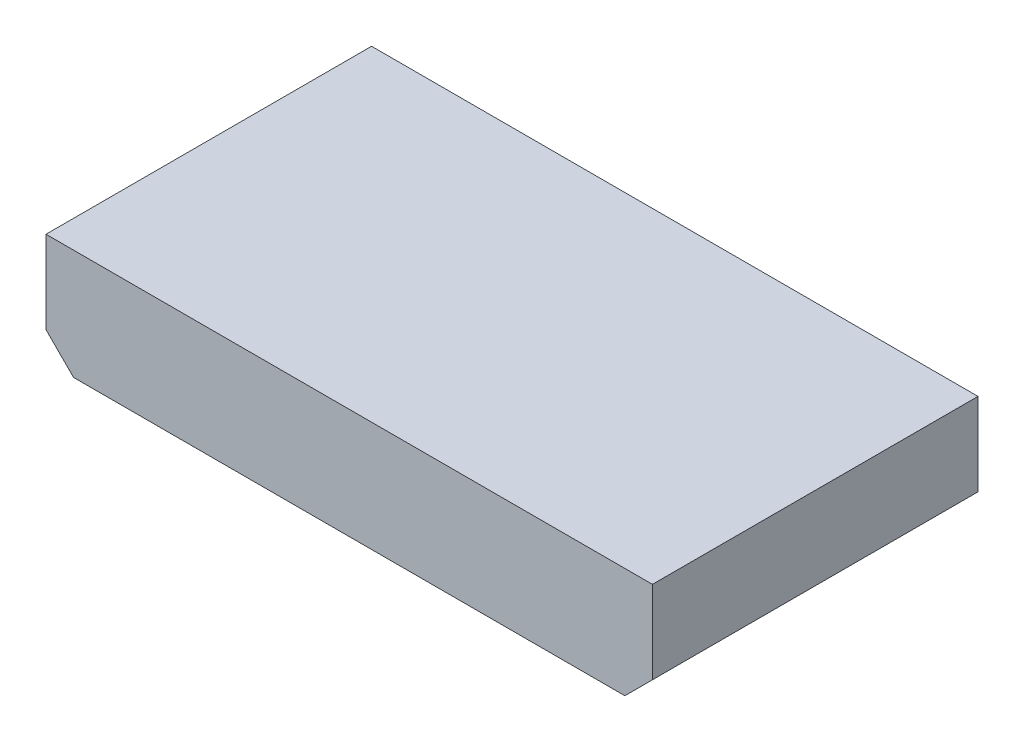
ISO-10303-21;
HEADER;
FILE_DESCRIPTION(('STEP AP214'),'2;1');
FILE_NAME('part.step','',(''),(''),'','','');
FILE_SCHEMA(('AUTOMOTIVE_DESIGN { 1 0 10303 214 1 1 1 1 }'));
ENDSEC;
DATA;
#1=APPLICATION_CONTEXT('core data for automotive mechanical design processes');
#2=APPLICATION_PROTOCOL_DEFINITION('international standard','automotive_design',2000,#1);
#3=PRODUCT_CONTEXT('',#1,'mechanical');
#4=PRODUCT('Part','Part','',(#3));
#5=PRODUCT_RELATED_PRODUCT_CATEGORY('part','',(#4));
#6=PRODUCT_DEFINITION_FORMATION('','',#4);
#7=PRODUCT_DEFINITION_CONTEXT('part definition',#1,'design');
#8=PRODUCT_DEFINITION('design','',#6,#7);
#9=PRODUCT_DEFINITION_SHAPE('','',#8);
#10=(LENGTH_UNIT() NAMED_UNIT(*) SI_UNIT(.MILLI.,.METRE.));
#11=(NAMED_UNIT(*) PLANE_ANGLE_UNIT() SI_UNIT($,.RADIAN.));
#12=(NAMED_UNIT(*) SI_UNIT($,.STERADIAN.) SOLID_ANGLE_UNIT());
#13=UNCERTAINTY_MEASURE_WITH_UNIT(LENGTH_MEASURE(1.E-05),#10,'distance_accuracy_value','');
#14=(GEOMETRIC_REPRESENTATION_CONTEXT(3) GLOBAL_UNCERTAINTY_ASSIGNED_CONTEXT((#13)) GLOBAL_UNIT_ASSIGNED_CONTEXT((#10,
#11,#12)) REPRESENTATION_CONTEXT('',''));
#15=CARTESIAN_POINT('',(0.,0.,0.));
#16=DIRECTION('',(0.,0.,1.));
#17=DIRECTION('',(1.,0.,0.));
#18=AXIS2_PLACEMENT_3D('',#15,#16,#17);
#19=CARTESIAN_POINT('',(17.78,0.,-2.));
#20=DIRECTION('',(0.,0.,1.));
#21=DIRECTION('',(1.,0.,0.));
#22=AXIS2_PLACEMENT_3D('',#19,#20,#21);
#23=CYLINDRICAL_SURFACE('',#22,0.25);
#24=CARTESIAN_POINT('',(17.78,0.,-2.));
#25=DIRECTION('',(0.,0.,1.));
#26=DIRECTION('',(1.,0.,0.));
#27=AXIS2_PLACEMENT_3D('',#24,#25,#26);
#28=CIRCLE('',#27,0.25);
#29=CARTESIAN_POINT('',(18.03,0.,-2.));
#30=VERTEX_POINT('',#29);
#31=EDGE_CURVE('E11',#30,#30,#28,.T.);
#32=ORIENTED_EDGE('',*,*,#31,.T.);
#33=EDGE_LOOP('',(#32));
#34=FACE_BOUND('',#33,.T.);
#35=CARTESIAN_POINT('',(17.78,0.,0.));
#36=DIRECTION('',(0.,0.,1.));
#37=DIRECTION('',(1.,0.,0.));
#38=AXIS2_PLACEMENT_3D('',#35,#36,#37);
#39=CIRCLE('',#38,0.25);
#40=CARTESIAN_POINT('',(18.03,0.,0.));
#41=VERTEX_POINT('',#40);
#42=EDGE_CURVE('E43',#41,#41,#39,.T.);
#43=ORIENTED_EDGE('',*,*,#42,.F.);
#44=EDGE_LOOP('',(#43));
#45=FACE_BOUND('',#44,.T.);
#46=ADVANCED_FACE('F40',(#34,#45),#23,.T.);
#47=CARTESIAN_POINT('',(17.78,0.,-2.));
#48=DIRECTION('',(0.,0.,1.));
#49=DIRECTION('',(1.,0.,0.));
#50=AXIS2_PLACEMENT_3D('',#47,#48,#49);
#51=PLANE('',#50);
#52=ORIENTED_EDGE('',*,*,#31,.F.);
#53=EDGE_LOOP('',(#52));
#54=FACE_BOUND('',#53,.T.);
#55=ADVANCED_FACE('F55',(#54),#51,.F.);
#56=CARTESIAN_POINT('',(17.78,0.,0.));
#57=DIRECTION('',(0.,0.,1.));
#58=DIRECTION('',(1.,0.,0.));
#59=AXIS2_PLACEMENT_3D('',#56,#57,#58);
#60=PLANE('',#59);
#61=ORIENTED_EDGE('',*,*,#42,.T.);
#62=EDGE_LOOP('',(#61));
#63=FACE_BOUND('',#62,.T.);
#64=ADVANCED_FACE('F52',(#63),#60,.T.);
#65=CLOSED_SHELL('',(#46,#55,#64));
#66=MANIFOLD_SOLID_BREP('B2',#65);
#67=CARTESIAN_POINT('',(15.24,0.,-2.));
#68=DIRECTION('',(0.,0.,1.));
#69=DIRECTION('',(1.,0.,0.));
#70=AXIS2_PLACEMENT_3D('',#67,#68,#69);
#71=CYLINDRICAL_SURFACE('',#70,0.25);
#72=CARTESIAN_POINT('',(15.24,0.,-2.));
#73=DIRECTION('',(0.,0.,1.));
#74=DIRECTION('',(1.,0.,0.));
#75=AXIS2_PLACEMENT_3D('',#72,#73,#74);
#76=CIRCLE('',#75,0.25);
#77=CARTESIAN_POINT('',(15.49,0.,-2.));
#78=VERTEX_POINT('',#77);
#79=EDGE_CURVE('E39',#78,#78,#76,.T.);
#80=ORIENTED_EDGE('',*,*,#79,.T.);
#81=EDGE_LOOP('',(#80));
#82=FACE_BOUND('',#81,.T.);
#83=CARTESIAN_POINT('',(15.24,0.,0.));
#84=DIRECTION('',(0.,0.,1.));
#85=DIRECTION('',(1.,0.,0.));
#86=AXIS2_PLACEMENT_3D('',#83,#84,#85);
#87=CIRCLE('',#86,0.25);
#88=CARTESIAN_POINT('',(15.49,0.,0.));
#89=VERTEX_POINT('',#88);
#90=EDGE_CURVE('E92',#89,#89,#87,.T.);
#91=ORIENTED_EDGE('',*,*,#90,.F.);
#92=EDGE_LOOP('',(#91));
#93=FACE_BOUND('',#92,.T.);
#94=ADVANCED_FACE('F89',(#82,#93),#71,.T.);
#95=CARTESIAN_POINT('',(15.24,0.,-2.));
#96=DIRECTION('',(0.,0.,1.));
#97=DIRECTION('',(1.,0.,0.));
#98=AXIS2_PLACEMENT_3D('',#95,#96,#97);
#99=PLANE('',#98);
#100=ORIENTED_EDGE('',*,*,#79,.F.);
#101=EDGE_LOOP('',(#100));
#102=FACE_BOUND('',#101,.T.);
#103=ADVANCED_FACE('F104',(#102),#99,.F.);
#104=CARTESIAN_POINT('',(15.24,0.,0.));
#105=DIRECTION('',(0.,0.,1.));
#106=DIRECTION('',(1.,0.,0.));
#107=AXIS2_PLACEMENT_3D('',#104,#105,#106);
#108=PLANE('',#107);
#109=ORIENTED_EDGE('',*,*,#90,.T.);
#110=EDGE_LOOP('',(#109));
#111=FACE_BOUND('',#110,.T.);
#112=ADVANCED_FACE('F101',(#111),#108,.T.);
#113=CLOSED_SHELL('',(#94,#103,#112));
#114=MANIFOLD_SOLID_BREP('B6',#113);
#115=CARTESIAN_POINT('',(12.7,0.,-2.));
#116=DIRECTION('',(0.,0.,1.));
#117=DIRECTION('',(1.,0.,0.));
#118=AXIS2_PLACEMENT_3D('',#115,#116,#117);
#119=CYLINDRICAL_SURFACE('',#118,0.25);
#120=CARTESIAN_POINT('',(12.7,0.,-2.));
#121=DIRECTION('',(0.,0.,1.));
#122=DIRECTION('',(1.,0.,0.));
#123=AXIS2_PLACEMENT_3D('',#120,#121,#122);
#124=CIRCLE('',#123,0.25);
#125=CARTESIAN_POINT('',(12.95,0.,-2.));
#126=VERTEX_POINT('',#125);
#127=EDGE_CURVE('E88',#126,#126,#124,.T.);
#128=ORIENTED_EDGE('',*,*,#127,.T.);
#129=EDGE_LOOP('',(#128));
#130=FACE_BOUND('',#129,.T.);
#131=CARTESIAN_POINT('',(12.7,0.,0.));
#132=DIRECTION('',(0.,0.,1.));
#133=DIRECTION('',(1.,0.,0.));
#134=AXIS2_PLACEMENT_3D('',#131,#132,#133);
#135=CIRCLE('',#134,0.25);
#136=CARTESIAN_POINT('',(12.95,0.,0.));
#137=VERTEX_POINT('',#136);
#138=EDGE_CURVE('E141',#137,#137,#135,.T.);
#139=ORIENTED_EDGE('',*,*,#138,.F.);
#140=EDGE_LOOP('',(#139));
#141=FACE_BOUND('',#140,.T.);
#142=ADVANCED_FACE('F138',(#130,#141),#119,.T.);
#143=CARTESIAN_POINT('',(12.7,0.,-2.));
#144=DIRECTION('',(0.,0.,1.));
#145=DIRECTION('',(1.,0.,0.));
#146=AXIS2_PLACEMENT_3D('',#143,#144,#145);
#147=PLANE('',#146);
#148=ORIENTED_EDGE('',*,*,#127,.F.);
#149=EDGE_LOOP('',(#148));
#150=FACE_BOUND('',#149,.T.);
#151=ADVANCED_FACE('F153',(#150),#147,.F.);
#152=CARTESIAN_POINT('',(12.7,0.,0.));
#153=DIRECTION('',(0.,0.,1.));
#154=DIRECTION('',(1.,0.,0.));
#155=AXIS2_PLACEMENT_3D('',#152,#153,#154);
#156=PLANE('',#155);
#157=ORIENTED_EDGE('',*,*,#138,.T.);
#158=EDGE_LOOP('',(#157));
#159=FACE_BOUND('',#158,.T.);
#160=ADVANCED_FACE('F150',(#159),#156,.T.);
#161=CLOSED_SHELL('',(#142,#151,#160));
#162=MANIFOLD_SOLID_BREP('B34',#161);
#163=CARTESIAN_POINT('',(10.16,0.,-2.));
#164=DIRECTION('',(0.,0.,1.));
#165=DIRECTION('',(1.,0.,0.));
#166=AXIS2_PLACEMENT_3D('',#163,#164,#165);
#167=CYLINDRICAL_SURFACE('',#166,0.25);
#168=CARTESIAN_POINT('',(10.16,0.,-2.));
#169=DIRECTION('',(0.,0.,1.));
#170=DIRECTION('',(1.,0.,0.));
#171=AXIS2_PLACEMENT_3D('',#168,#169,#170);
#172=CIRCLE('',#171,0.25);
#173=CARTESIAN_POINT('',(10.41,0.,-2.));
#174=VERTEX_POINT('',#173);
#175=EDGE_CURVE('E137',#174,#174,#172,.T.);
#176=ORIENTED_EDGE('',*,*,#175,.T.);
#177=EDGE_LOOP('',(#176));
#178=FACE_BOUND('',#177,.T.);
#179=CARTESIAN_POINT('',(10.16,0.,0.));
#180=DIRECTION('',(0.,0.,1.));
#181=DIRECTION('',(1.,0.,0.));
#182=AXIS2_PLACEMENT_3D('',#179,#180,#181);
#183=CIRCLE('',#182,0.25);
#184=CARTESIAN_POINT('',(10.41,0.,0.));
#185=VERTEX_POINT('',#184);
#186=EDGE_CURVE('E190',#185,#185,#183,.T.);
#187=ORIENTED_EDGE('',*,*,#186,.F.);
#188=EDGE_LOOP('',(#187));
#189=FACE_BOUND('',#188,.T.);
#190=ADVANCED_FACE('F187',(#178,#189),#167,.T.);
#191=CARTESIAN_POINT('',(10.16,0.,-2.));
#192=DIRECTION('',(0.,0.,1.));
#193=DIRECTION('',(1.,0.,0.));
#194=AXIS2_PLACEMENT_3D('',#191,#192,#193);
#195=PLANE('',#194);
#196=ORIENTED_EDGE('',*,*,#175,.F.);
#197=EDGE_LOOP('',(#196));
#198=FACE_BOUND('',#197,.T.);
#199=ADVANCED_FACE('F202',(#198),#195,.F.);
#200=CARTESIAN_POINT('',(10.16,0.,0.));
#201=DIRECTION('',(0.,0.,1.));
#202=DIRECTION('',(1.,0.,0.));
#203=AXIS2_PLACEMENT_3D('',#200,#201,#202);
#204=PLANE('',#203);
#205=ORIENTED_EDGE('',*,*,#186,.T.);
#206=EDGE_LOOP('',(#205));
#207=FACE_BOUND('',#206,.T.);
#208=ADVANCED_FACE('F199',(#207),#204,.T.);
#209=CLOSED_SHELL('',(#190,#199,#208));
#210=MANIFOLD_SOLID_BREP('B83',#209);
#211=CARTESIAN_POINT('',(7.62,0.,-2.));
#212=DIRECTION('',(0.,0.,1.));
#213=DIRECTION('',(1.,0.,0.));
#214=AXIS2_PLACEMENT_3D('',#211,#212,#213);
#215=CYLINDRICAL_SURFACE('',#214,0.25);
#216=CARTESIAN_POINT('',(7.62,0.,-2.));
#217=DIRECTION('',(0.,0.,1.));
#218=DIRECTION('',(1.,0.,0.));
#219=AXIS2_PLACEMENT_3D('',#216,#217,#218);
#220=CIRCLE('',#219,0.25);
#221=CARTESIAN_POINT('',(7.87,0.,-2.));
#222=VERTEX_POINT('',#221);
#223=EDGE_CURVE('E186',#222,#222,#220,.T.);
#224=ORIENTED_EDGE('',*,*,#223,.T.);
#225=EDGE_LOOP('',(#224));
#226=FACE_BOUND('',#225,.T.);
#227=CARTESIAN_POINT('',(7.62,0.,0.));
#228=DIRECTION('',(0.,0.,1.));
#229=DIRECTION('',(1.,0.,0.));
#230=AXIS2_PLACEMENT_3D('',#227,#228,#229);
#231=CIRCLE('',#230,0.25);
#232=CARTESIAN_POINT('',(7.87,0.,0.));
#233=VERTEX_POINT('',#232);
#234=EDGE_CURVE('E239',#233,#233,#231,.T.);
#235=ORIENTED_EDGE('',*,*,#234,.F.);
#236=EDGE_LOOP('',(#235));
#237=FACE_BOUND('',#236,.T.);
#238=ADVANCED_FACE('F236',(#226,#237),#215,.T.);
#239=CARTESIAN_POINT('',(7.62,0.,-2.));
#240=DIRECTION('',(0.,0.,1.));
#241=DIRECTION('',(1.,0.,0.));
#242=AXIS2_PLACEMENT_3D('',#239,#240,#241);
#243=PLANE('',#242);
#244=ORIENTED_EDGE('',*,*,#223,.F.);
#245=EDGE_LOOP('',(#244));
#246=FACE_BOUND('',#245,.T.);
#247=ADVANCED_FACE('F251',(#246),#243,.F.);
#248=CARTESIAN_POINT('',(7.62,0.,0.));
#249=DIRECTION('',(0.,0.,1.));
#250=DIRECTION('',(1.,0.,0.));
#251=AXIS2_PLACEMENT_3D('',#248,#249,#250);
#252=PLANE('',#251);
#253=ORIENTED_EDGE('',*,*,#234,.T.);
#254=EDGE_LOOP('',(#253));
#255=FACE_BOUND('',#254,.T.);
#256=ADVANCED_FACE('F248',(#255),#252,.T.);
#257=CLOSED_SHELL('',(#238,#247,#256));
#258=MANIFOLD_SOLID_BREP('B132',#257);
#259=CARTESIAN_POINT('',(5.08,0.,-2.));
#260=DIRECTION('',(0.,0.,1.));
#261=DIRECTION('',(1.,0.,0.));
#262=AXIS2_PLACEMENT_3D('',#259,#260,#261);
#263=CYLINDRICAL_SURFACE('',#262,0.25);
#264=CARTESIAN_POINT('',(5.08,0.,-2.));
#265=DIRECTION('',(0.,0.,1.));
#266=DIRECTION('',(1.,0.,0.));
#267=AXIS2_PLACEMENT_3D('',#264,#265,#266);
#268=CIRCLE('',#267,0.25);
#269=CARTESIAN_POINT('',(5.33,0.,-2.));
#270=VERTEX_POINT('',#269);
#271=EDGE_CURVE('E235',#270,#270,#268,.T.);
#272=ORIENTED_EDGE('',*,*,#271,.T.);
#273=EDGE_LOOP('',(#272));
#274=FACE_BOUND('',#273,.T.);
#275=CARTESIAN_POINT('',(5.08,0.,0.));
#276=DIRECTION('',(0.,0.,1.));
#277=DIRECTION('',(1.,0.,0.));
#278=AXIS2_PLACEMENT_3D('',#275,#276,#277);
#279=CIRCLE('',#278,0.25);
#280=CARTESIAN_POINT('',(5.33,0.,0.));
#281=VERTEX_POINT('',#280);
#282=EDGE_CURVE('E288',#281,#281,#279,.T.);
#283=ORIENTED_EDGE('',*,*,#282,.F.);
#284=EDGE_LOOP('',(#283));
#285=FACE_BOUND('',#284,.T.);
#286=ADVANCED_FACE('F285',(#274,#285),#263,.T.);
#287=CARTESIAN_POINT('',(5.08,0.,-2.));
#288=DIRECTION('',(0.,0.,1.));
#289=DIRECTION('',(1.,0.,0.));
#290=AXIS2_PLACEMENT_3D('',#287,#288,#289);
#291=PLANE('',#290);
#292=ORIENTED_EDGE('',*,*,#271,.F.);
#293=EDGE_LOOP('',(#292));
#294=FACE_BOUND('',#293,.T.);
#295=ADVANCED_FACE('F300',(#294),#291,.F.);
#296=CARTESIAN_POINT('',(5.08,0.,0.));
#297=DIRECTION('',(0.,0.,1.));
#298=DIRECTION('',(1.,0.,0.));
#299=AXIS2_PLACEMENT_3D('',#296,#297,#298);
#300=PLANE('',#299);
#301=ORIENTED_EDGE('',*,*,#282,.T.);
#302=EDGE_LOOP('',(#301));
#303=FACE_BOUND('',#302,.T.);
#304=ADVANCED_FACE('F297',(#303),#300,.T.);
#305=CLOSED_SHELL('',(#286,#295,#304));
#306=MANIFOLD_SOLID_BREP('B181',#305);
#307=CARTESIAN_POINT('',(2.54,0.,-2.));
#308=DIRECTION('',(0.,0.,1.));
#309=DIRECTION('',(1.,0.,0.));
#310=AXIS2_PLACEMENT_3D('',#307,#308,#309);
#311=CYLINDRICAL_SURFACE('',#310,0.25);
#312=CARTESIAN_POINT('',(2.54,0.,-2.));
#313=DIRECTION('',(0.,0.,1.));
#314=DIRECTION('',(1.,0.,0.));
#315=AXIS2_PLACEMENT_3D('',#312,#313,#314);
#316=CIRCLE('',#315,0.25);
#317=CARTESIAN_POINT('',(2.79,0.,-2.));
#318=VERTEX_POINT('',#317);
#319=EDGE_CURVE('E284',#318,#318,#316,.T.);
#320=ORIENTED_EDGE('',*,*,#319,.T.);
#321=EDGE_LOOP('',(#320));
#322=FACE_BOUND('',#321,.T.);
#323=CARTESIAN_POINT('',(2.54,0.,0.));
#324=DIRECTION('',(0.,0.,1.));
#325=DIRECTION('',(1.,0.,0.));
#326=AXIS2_PLACEMENT_3D('',#323,#324,#325);
#327=CIRCLE('',#326,0.25);
#328=CARTESIAN_POINT('',(2.79,0.,0.));
#329=VERTEX_POINT('',#328);
#330=EDGE_CURVE('E337',#329,#329,#327,.T.);
#331=ORIENTED_EDGE('',*,*,#330,.F.);
#332=EDGE_LOOP('',(#331));
#333=FACE_BOUND('',#332,.T.);
#334=ADVANCED_FACE('F334',(#322,#333),#311,.T.);
#335=CARTESIAN_POINT('',(2.54,0.,-2.));
#336=DIRECTION('',(0.,0.,1.));
#337=DIRECTION('',(1.,0.,0.));
#338=AXIS2_PLACEMENT_3D('',#335,#336,#337);
#339=PLANE('',#338);
#340=ORIENTED_EDGE('',*,*,#319,.F.);
#341=EDGE_LOOP('',(#340));
#342=FACE_BOUND('',#341,.T.);
#343=ADVANCED_FACE('F349',(#342),#339,.F.);
#344=CARTESIAN_POINT('',(2.54,0.,0.));
#345=DIRECTION('',(0.,0.,1.));
#346=DIRECTION('',(1.,0.,0.));
#347=AXIS2_PLACEMENT_3D('',#344,#345,#346);
#348=PLANE('',#347);
#349=ORIENTED_EDGE('',*,*,#330,.T.);
#350=EDGE_LOOP('',(#349));
#351=FACE_BOUND('',#350,.T.);
#352=ADVANCED_FACE('F346',(#351),#348,.T.);
#353=CLOSED_SHELL('',(#334,#343,#352));
#354=MANIFOLD_SOLID_BREP('B230',#353);
#355=CARTESIAN_POINT('',(0.,0.,-2.));
#356=DIRECTION('',(0.,0.,1.));
#357=DIRECTION('',(1.,0.,0.));
#358=AXIS2_PLACEMENT_3D('',#355,#356,#357);
#359=CYLINDRICAL_SURFACE('',#358,0.25);
#360=CARTESIAN_POINT('',(0.,0.,-2.));
#361=DIRECTION('',(0.,0.,1.));
#362=DIRECTION('',(1.,0.,0.));
#363=AXIS2_PLACEMENT_3D('',#360,#361,#362);
#364=CIRCLE('',#363,0.25);
#365=CARTESIAN_POINT('',(0.25,0.,-2.));
#366=VERTEX_POINT('',#365);
#367=EDGE_CURVE('E333',#366,#366,#364,.T.);
#368=ORIENTED_EDGE('',*,*,#367,.T.);
#369=EDGE_LOOP('',(#368));
#370=FACE_BOUND('',#369,.T.);
#371=CARTESIAN_POINT('',(0.,0.,0.));
#372=DIRECTION('',(0.,0.,1.));
#373=DIRECTION('',(1.,0.,0.));
#374=AXIS2_PLACEMENT_3D('',#371,#372,#373);
#375=CIRCLE('',#374,0.25);
#376=CARTESIAN_POINT('',(0.25,0.,0.));
#377=VERTEX_POINT('',#376);
#378=EDGE_CURVE('E387',#377,#377,#375,.T.);
#379=ORIENTED_EDGE('',*,*,#378,.F.);
#380=EDGE_LOOP('',(#379));
#381=FACE_BOUND('',#380,.T.);
#382=ADVANCED_FACE('F384',(#370,#381),#359,.T.);
#383=CARTESIAN_POINT('',(0.,0.,-2.));
#384=DIRECTION('',(0.,0.,1.));
#385=DIRECTION('',(1.,0.,0.));
#386=AXIS2_PLACEMENT_3D('',#383,#384,#385);
#387=PLANE('',#386);
#388=ORIENTED_EDGE('',*,*,#367,.F.);
#389=EDGE_LOOP('',(#388));
#390=FACE_BOUND('',#389,.T.);
#391=ADVANCED_FACE('F399',(#390),#387,.F.);
#392=CARTESIAN_POINT('',(0.,0.,0.));
#393=DIRECTION('',(0.,0.,1.));
#394=DIRECTION('',(1.,0.,0.));
#395=AXIS2_PLACEMENT_3D('',#392,#393,#394);
#396=PLANE('',#395);
#397=ORIENTED_EDGE('',*,*,#378,.T.);
#398=EDGE_LOOP('',(#397));
#399=FACE_BOUND('',#398,.T.);
#400=ADVANCED_FACE('F396',(#399),#396,.T.);
#401=CLOSED_SHELL('',(#382,#391,#400));
#402=MANIFOLD_SOLID_BREP('B279',#401);
#403=CARTESIAN_POINT('',(22.86,2.54,15.));
#404=DIRECTION('',(0.,-1.,0.));
#405=DIRECTION('',(0.,0.,-1.));
#406=AXIS2_PLACEMENT_3D('',#403,#404,#405);
#407=PLANE('',#406);
#408=DIRECTION('',(-1.,0.,0.));
#409=VECTOR('',#408,1.);
#410=CARTESIAN_POINT('',(22.86,2.54,0.));
#411=LINE('',#410,#409);
#412=CARTESIAN_POINT('',(22.86,2.54,0.));
#413=VERTEX_POINT('',#412);
#414=CARTESIAN_POINT('',(-5.08,2.54,0.));
#415=VERTEX_POINT('',#414);
#416=EDGE_CURVE('E509',#413,#415,#411,.T.);
#417=ORIENTED_EDGE('',*,*,#416,.T.);
#418=DIRECTION('',(0.,0.,-1.));
#419=VECTOR('',#418,1.);
#420=CARTESIAN_POINT('',(-5.08,2.54,15.));
#421=LINE('',#420,#419);
#422=CARTESIAN_POINT('',(-5.08,2.54,15.));
#423=VERTEX_POINT('',#422);
#424=EDGE_CURVE('E382',#423,#415,#421,.T.);
#425=ORIENTED_EDGE('',*,*,#424,.F.);
#426=DIRECTION('',(-1.,0.,0.));
#427=VECTOR('',#426,1.);
#428=CARTESIAN_POINT('',(22.86,2.54,15.));
#429=LINE('',#428,#427);
#430=CARTESIAN_POINT('',(22.86,2.54,15.));
#431=VERTEX_POINT('',#430);
#432=EDGE_CURVE('E519',#431,#423,#429,.T.);
#433=ORIENTED_EDGE('',*,*,#432,.F.);
#434=DIRECTION('',(0.,0.,-1.));
#435=VECTOR('',#434,1.);
#436=CARTESIAN_POINT('',(22.86,2.54,15.));
#437=LINE('',#436,#435);
#438=EDGE_CURVE('E505',#431,#413,#437,.T.);
#439=ORIENTED_EDGE('',*,*,#438,.T.);
#440=EDGE_LOOP('',(#417,#425,#433,#439));
#441=FACE_BOUND('',#440,.T.);
#442=ADVANCED_FACE('F425',(#441),#407,.F.);
#443=CARTESIAN_POINT('',(-5.08,2.54,15.));
#444=DIRECTION('',(1.,0.,0.));
#445=DIRECTION('',(0.,0.,-1.));
#446=AXIS2_PLACEMENT_3D('',#443,#444,#445);
#447=PLANE('',#446);
#448=DIRECTION('',(0.,-1.,0.));
#449=VECTOR('',#448,1.);
#450=CARTESIAN_POINT('',(-5.08,2.54,0.));
#451=LINE('',#450,#449);
#452=CARTESIAN_POINT('',(-5.08,-1.27,0.));
#453=VERTEX_POINT('',#452);
#454=EDGE_CURVE('E512',#415,#453,#451,.T.);
#455=ORIENTED_EDGE('',*,*,#454,.T.);
#456=DIRECTION('',(0.,0.,-1.));
#457=VECTOR('',#456,1.);
#458=CARTESIAN_POINT('',(-5.08,-1.27,15.));
#459=LINE('',#458,#457);
#460=CARTESIAN_POINT('',(-5.08,-1.27,15.));
#461=VERTEX_POINT('',#460);
#462=EDGE_CURVE('E433',#461,#453,#459,.T.);
#463=ORIENTED_EDGE('',*,*,#462,.F.);
#464=DIRECTION('',(0.,-1.,0.));
#465=VECTOR('',#464,1.);
#466=CARTESIAN_POINT('',(-5.08,2.54,15.));
#467=LINE('',#466,#465);
#468=EDGE_CURVE('E478',#423,#461,#467,.T.);
#469=ORIENTED_EDGE('',*,*,#468,.F.);
#470=ORIENTED_EDGE('',*,*,#424,.T.);
#471=EDGE_LOOP('',(#455,#463,#469,#470));
#472=FACE_BOUND('',#471,.T.);
#473=ADVANCED_FACE('F543',(#472),#447,.F.);
#474=CARTESIAN_POINT('',(-5.08,-1.27,15.));
#475=DIRECTION('',(0.707106781186547,0.707106781186548,0.));
#476=DIRECTION('',(-0.707106781186548,0.707106781186547,0.));
#477=AXIS2_PLACEMENT_3D('',#474,#475,#476);
#478=PLANE('',#477);
#479=DIRECTION('',(0.707106781186548,-0.707106781186547,0.));
#480=VECTOR('',#479,1.);
#481=CARTESIAN_POINT('',(-5.08,-1.27,0.));
#482=LINE('',#481,#480);
#483=CARTESIAN_POINT('',(-3.81,-2.54,0.));
#484=VERTEX_POINT('',#483);
#485=EDGE_CURVE('E514',#453,#484,#482,.T.);
#486=ORIENTED_EDGE('',*,*,#485,.T.);
#487=DIRECTION('',(0.,0.,-1.));
#488=VECTOR('',#487,1.);
#489=CARTESIAN_POINT('',(-3.81,-2.54,15.));
#490=LINE('',#489,#488);
#491=CARTESIAN_POINT('',(-3.81,-2.54,15.));
#492=VERTEX_POINT('',#491);
#493=EDGE_CURVE('E500',#492,#484,#490,.T.);
#494=ORIENTED_EDGE('',*,*,#493,.F.);
#495=DIRECTION('',(0.707106781186548,-0.707106781186547,0.));
#496=VECTOR('',#495,1.);
#497=CARTESIAN_POINT('',(-5.08,-1.27,15.));
#498=LINE('',#497,#496);
#499=EDGE_CURVE('E491',#461,#492,#498,.T.);
#500=ORIENTED_EDGE('',*,*,#499,.F.);
#501=ORIENTED_EDGE('',*,*,#462,.T.);
#502=EDGE_LOOP('',(#486,#494,#500,#501));
#503=FACE_BOUND('',#502,.T.);
#504=ADVANCED_FACE('F525',(#503),#478,.F.);
#505=CARTESIAN_POINT('',(-3.81,-2.54,15.));
#506=DIRECTION('',(0.,1.,0.));
#507=DIRECTION('',(0.,0.,1.));
#508=AXIS2_PLACEMENT_3D('',#505,#506,#507);
#509=PLANE('',#508);
#510=DIRECTION('',(1.,0.,0.));
#511=VECTOR('',#510,1.);
#512=CARTESIAN_POINT('',(-3.81,-2.54,0.));
#513=LINE('',#512,#511);
#514=CARTESIAN_POINT('',(21.59,-2.54,0.));
#515=VERTEX_POINT('',#514);
#516=EDGE_CURVE('E499',#484,#515,#513,.T.);
#517=ORIENTED_EDGE('',*,*,#516,.T.);
#518=DIRECTION('',(0.,0.,-1.));
#519=VECTOR('',#518,1.);
#520=CARTESIAN_POINT('',(21.59,-2.54,15.));
#521=LINE('',#520,#519);
#522=CARTESIAN_POINT('',(21.59,-2.54,15.));
#523=VERTEX_POINT('',#522);
#524=EDGE_CURVE('E496',#523,#515,#521,.T.);
#525=ORIENTED_EDGE('',*,*,#524,.F.);
#526=DIRECTION('',(1.,0.,0.));
#527=VECTOR('',#526,1.);
#528=CARTESIAN_POINT('',(-3.81,-2.54,15.));
#529=LINE('',#528,#527);
#530=EDGE_CURVE('E485',#492,#523,#529,.T.);
#531=ORIENTED_EDGE('',*,*,#530,.F.);
#532=ORIENTED_EDGE('',*,*,#493,.T.);
#533=EDGE_LOOP('',(#517,#525,#531,#532));
#534=FACE_BOUND('',#533,.T.);
#535=ADVANCED_FACE('F497',(#534),#509,.F.);
#536=CARTESIAN_POINT('',(21.59,-2.54,15.));
#537=DIRECTION('',(-0.707106781186549,0.707106781186547,0.));
#538=DIRECTION('',(-0.707106781186547,-0.707106781186549,0.));
#539=AXIS2_PLACEMENT_3D('',#536,#537,#538);
#540=PLANE('',#539);
#541=DIRECTION('',(0.707106781186547,0.707106781186548,0.));
#542=VECTOR('',#541,1.);
#543=CARTESIAN_POINT('',(21.59,-2.54,0.));
#544=LINE('',#543,#542);
#545=CARTESIAN_POINT('',(22.86,-1.27,0.));
#546=VERTEX_POINT('',#545);
#547=EDGE_CURVE('E464',#515,#546,#544,.T.);
#548=ORIENTED_EDGE('',*,*,#547,.T.);
#549=DIRECTION('',(0.,0.,-1.));
#550=VECTOR('',#549,1.);
#551=CARTESIAN_POINT('',(22.86,-1.27,15.));
#552=LINE('',#551,#550);
#553=CARTESIAN_POINT('',(22.86,-1.27,15.));
#554=VERTEX_POINT('',#553);
#555=EDGE_CURVE('E501',#554,#546,#552,.T.);
#556=ORIENTED_EDGE('',*,*,#555,.F.);
#557=DIRECTION('',(0.707106781186547,0.707106781186548,0.));
#558=VECTOR('',#557,1.);
#559=CARTESIAN_POINT('',(21.59,-2.54,15.));
#560=LINE('',#559,#558);
#561=EDGE_CURVE('E489',#523,#554,#560,.T.);
#562=ORIENTED_EDGE('',*,*,#561,.F.);
#563=ORIENTED_EDGE('',*,*,#524,.T.);
#564=EDGE_LOOP('',(#548,#556,#562,#563));
#565=FACE_BOUND('',#564,.T.);
#566=ADVANCED_FACE('F503',(#565),#540,.F.);
#567=CARTESIAN_POINT('',(22.86,-1.27,15.));
#568=DIRECTION('',(-1.,0.,0.));
#569=DIRECTION('',(0.,0.,1.));
#570=AXIS2_PLACEMENT_3D('',#567,#568,#569);
#571=PLANE('',#570);
#572=DIRECTION('',(0.,1.,0.));
#573=VECTOR('',#572,1.);
#574=CARTESIAN_POINT('',(22.86,-1.27,0.));
#575=LINE('',#574,#573);
#576=EDGE_CURVE('E470',#546,#413,#575,.T.);
#577=ORIENTED_EDGE('',*,*,#576,.T.);
#578=ORIENTED_EDGE('',*,*,#438,.F.);
#579=DIRECTION('',(0.,1.,0.));
#580=VECTOR('',#579,1.);
#581=CARTESIAN_POINT('',(22.86,-1.27,15.));
#582=LINE('',#581,#580);
#583=EDGE_CURVE('E441',#554,#431,#582,.T.);
#584=ORIENTED_EDGE('',*,*,#583,.F.);
#585=ORIENTED_EDGE('',*,*,#555,.T.);
#586=EDGE_LOOP('',(#577,#578,#584,#585));
#587=FACE_BOUND('',#586,.T.);
#588=ADVANCED_FACE('F532',(#587),#571,.F.);
#589=CARTESIAN_POINT('',(0.,0.,15.));
#590=DIRECTION('',(0.,0.,1.));
#591=DIRECTION('',(1.,0.,0.));
#592=AXIS2_PLACEMENT_3D('',#589,#590,#591);
#593=PLANE('',#592);
#594=ORIENTED_EDGE('',*,*,#432,.T.);
#595=ORIENTED_EDGE('',*,*,#468,.T.);
#596=ORIENTED_EDGE('',*,*,#499,.T.);
#597=ORIENTED_EDGE('',*,*,#530,.T.);
#598=ORIENTED_EDGE('',*,*,#561,.T.);
#599=ORIENTED_EDGE('',*,*,#583,.T.);
#600=EDGE_LOOP('',(#594,#595,#596,#597,#598,#599));
#601=FACE_BOUND('',#600,.T.);
#602=ADVANCED_FACE('F487',(#601),#593,.T.);
#603=CARTESIAN_POINT('',(0.,0.,0.));
#604=DIRECTION('',(0.,0.,1.));
#605=DIRECTION('',(1.,0.,0.));
#606=AXIS2_PLACEMENT_3D('',#603,#604,#605);
#607=PLANE('',#606);
#608=ORIENTED_EDGE('',*,*,#416,.F.);
#609=ORIENTED_EDGE('',*,*,#576,.F.);
#610=ORIENTED_EDGE('',*,*,#547,.F.);
#611=ORIENTED_EDGE('',*,*,#516,.F.);
#612=ORIENTED_EDGE('',*,*,#485,.F.);
#613=ORIENTED_EDGE('',*,*,#454,.F.);
#614=EDGE_LOOP('',(#608,#609,#610,#611,#612,#613));
#615=FACE_BOUND('',#614,.T.);
#616=ADVANCED_FACE('F528',(#615),#607,.F.);
#617=CLOSED_SHELL('',(#442,#473,#504,#535,#566,#588,#602,#616));
#618=MANIFOLD_SOLID_BREP('B328',#617);
#619=ADVANCED_BREP_SHAPE_REPRESENTATION('',(#18,#66,#114,#162,#210,#258,#306,#354,#402,#618),#14);
#620=SHAPE_DEFINITION_REPRESENTATION(#9,#619);
ENDSEC;
END-ISO-10303-21;
